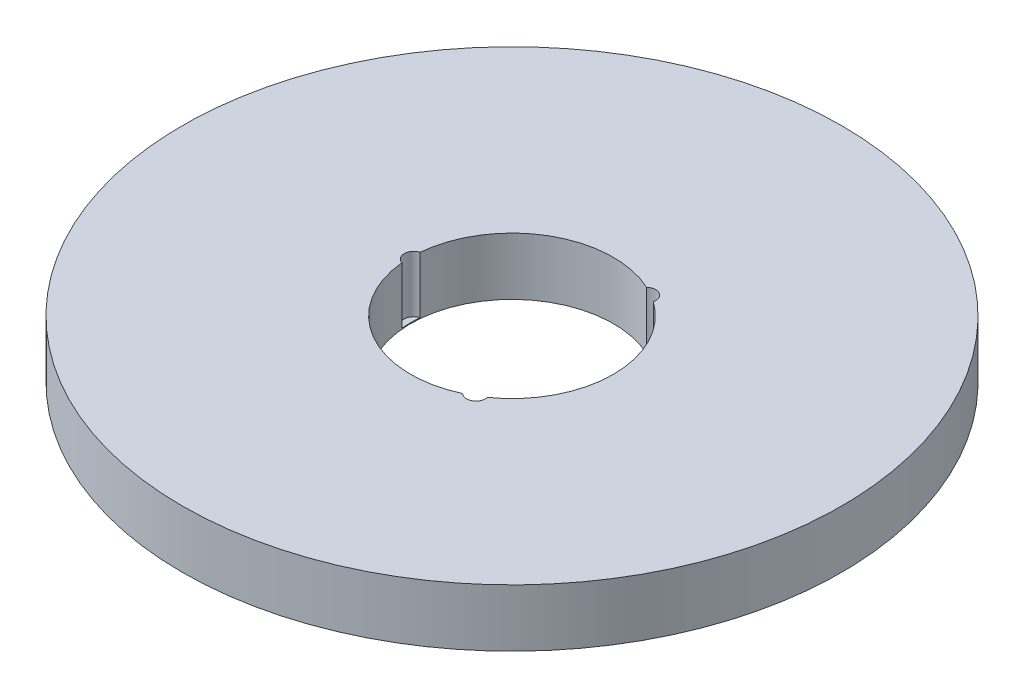
ISO-10303-21;
HEADER;
FILE_DESCRIPTION(('STEP AP214'),'2;1');
FILE_NAME('part.step','',(''),(''),'','','');
FILE_SCHEMA(('AUTOMOTIVE_DESIGN { 1 0 10303 214 1 1 1 1 }'));
ENDSEC;
DATA;
#1=APPLICATION_CONTEXT('core data for automotive mechanical design processes');
#2=APPLICATION_PROTOCOL_DEFINITION('international standard','automotive_design',2000,#1);
#3=PRODUCT_CONTEXT('',#1,'mechanical');
#4=PRODUCT('Part','Part','',(#3));
#5=PRODUCT_RELATED_PRODUCT_CATEGORY('part','',(#4));
#6=PRODUCT_DEFINITION_FORMATION('','',#4);
#7=PRODUCT_DEFINITION_CONTEXT('part definition',#1,'design');
#8=PRODUCT_DEFINITION('design','',#6,#7);
#9=PRODUCT_DEFINITION_SHAPE('','',#8);
#10=(LENGTH_UNIT() NAMED_UNIT(*) SI_UNIT(.MILLI.,.METRE.));
#11=(NAMED_UNIT(*) PLANE_ANGLE_UNIT() SI_UNIT($,.RADIAN.));
#12=(NAMED_UNIT(*) SI_UNIT($,.STERADIAN.) SOLID_ANGLE_UNIT());
#13=UNCERTAINTY_MEASURE_WITH_UNIT(LENGTH_MEASURE(1.E-05),#10,'distance_accuracy_value','');
#14=(GEOMETRIC_REPRESENTATION_CONTEXT(3) GLOBAL_UNCERTAINTY_ASSIGNED_CONTEXT((#13)) GLOBAL_UNIT_ASSIGNED_CONTEXT((#10,
#11,#12)) REPRESENTATION_CONTEXT('',''));
#15=CARTESIAN_POINT('',(0.,0.,0.));
#16=DIRECTION('',(0.,0.,1.));
#17=DIRECTION('',(1.,0.,0.));
#18=AXIS2_PLACEMENT_3D('',#15,#16,#17);
#19=CARTESIAN_POINT('',(0.,17.,0.));
#20=DIRECTION('',(0.,-1.,0.));
#21=DIRECTION('',(0.,0.,-1.));
#22=AXIS2_PLACEMENT_3D('',#19,#20,#21);
#23=CYLINDRICAL_SURFACE('',#22,97.5);
#24=CARTESIAN_POINT('',(0.,17.,0.));
#25=DIRECTION('',(0.,1.,0.));
#26=DIRECTION('',(0.,0.,1.));
#27=AXIS2_PLACEMENT_3D('',#24,#25,#26);
#28=CIRCLE('',#27,97.5);
#29=CARTESIAN_POINT('',(0.,17.,97.5));
#30=VERTEX_POINT('',#29);
#31=EDGE_CURVE('E130',#30,#30,#28,.T.);
#32=ORIENTED_EDGE('',*,*,#31,.F.);
#33=EDGE_LOOP('',(#32));
#34=FACE_BOUND('',#33,.T.);
#35=CARTESIAN_POINT('',(0.,0.,0.));
#36=DIRECTION('',(0.,1.,0.));
#37=DIRECTION('',(0.,0.,1.));
#38=AXIS2_PLACEMENT_3D('',#35,#36,#37);
#39=CIRCLE('',#38,97.5);
#40=CARTESIAN_POINT('',(0.,0.,97.5));
#41=VERTEX_POINT('',#40);
#42=EDGE_CURVE('E117',#41,#41,#39,.T.);
#43=ORIENTED_EDGE('',*,*,#42,.T.);
#44=EDGE_LOOP('',(#43));
#45=FACE_BOUND('',#44,.T.);
#46=ADVANCED_FACE('F39',(#34,#45),#23,.T.);
#47=CARTESIAN_POINT('',(0.,17.,0.));
#48=DIRECTION('',(0.,1.,0.));
#49=DIRECTION('',(0.,0.,1.));
#50=AXIS2_PLACEMENT_3D('',#47,#48,#49);
#51=PLANE('',#50);
#52=CARTESIAN_POINT('',(14.5297397758314,17.,25.1662475124942));
#53=DIRECTION('',(0.,1.,0.));
#54=DIRECTION('',(0.866025403784436,0.,-0.500000000000004));
#55=AXIS2_PLACEMENT_3D('',#52,#53,#54);
#56=CIRCLE('',#55,2.81733643312998);
#57=CARTESIAN_POINT('',(12.6048523469208,17.,27.2234769511965));
#58=VERTEX_POINT('',#57);
#59=CARTESIAN_POINT('',(17.2737964456161,17.,24.5278608189834));
#60=VERTEX_POINT('',#59);
#61=EDGE_CURVE('E148',#58,#60,#56,.T.);
#62=ORIENTED_EDGE('',*,*,#61,.F.);
#63=CARTESIAN_POINT('',(0.,17.,0.));
#64=DIRECTION('',(0.,1.,0.));
#65=DIRECTION('',(0.,0.,1.));
#66=AXIS2_PLACEMENT_3D('',#63,#64,#65);
#67=CIRCLE('',#66,30.);
#68=CARTESIAN_POINT('',(-29.8786487925367,17.,2.69561613221309));
#69=VERTEX_POINT('',#68);
#70=EDGE_CURVE('E113',#69,#58,#67,.T.);
#71=ORIENTED_EDGE('',*,*,#70,.F.);
#72=CARTESIAN_POINT('',(-29.0594795516626,17.,0.));
#73=DIRECTION('',(0.,1.,0.));
#74=DIRECTION('',(0.,0.,1.));
#75=AXIS2_PLACEMENT_3D('',#72,#73,#74);
#76=CIRCLE('',#75,2.81733643312998);
#77=CARTESIAN_POINT('',(-29.8786487925367,17.,-2.69561613221309));
#78=VERTEX_POINT('',#77);
#79=EDGE_CURVE('E125',#78,#69,#76,.T.);
#80=ORIENTED_EDGE('',*,*,#79,.F.);
#81=CARTESIAN_POINT('',(12.6048523469204,17.,-27.2234769511967));
#82=VERTEX_POINT('',#81);
#83=EDGE_CURVE('E107',#82,#78,#67,.T.);
#84=ORIENTED_EDGE('',*,*,#83,.F.);
#85=CARTESIAN_POINT('',(14.5297397758311,17.,-25.1662475124944));
#86=DIRECTION('',(0.,1.,0.));
#87=DIRECTION('',(-0.866025403784443,0.,-0.499999999999992));
#88=AXIS2_PLACEMENT_3D('',#85,#86,#87);
#89=CIRCLE('',#88,2.81733643312998);
#90=CARTESIAN_POINT('',(17.2737964456158,17.,-24.5278608189836));
#91=VERTEX_POINT('',#90);
#92=EDGE_CURVE('E95',#91,#82,#89,.T.);
#93=ORIENTED_EDGE('',*,*,#92,.F.);
#94=EDGE_CURVE('E106',#60,#91,#67,.T.);
#95=ORIENTED_EDGE('',*,*,#94,.F.);
#96=EDGE_LOOP('',(#62,#71,#80,#84,#93,#95));
#97=FACE_BOUND('',#96,.T.);
#98=ORIENTED_EDGE('',*,*,#31,.T.);
#99=EDGE_LOOP('',(#98));
#100=FACE_BOUND('',#99,.T.);
#101=ADVANCED_FACE('F102',(#97,#100),#51,.T.);
#102=CARTESIAN_POINT('',(0.,0.,0.));
#103=DIRECTION('',(0.,1.,0.));
#104=DIRECTION('',(0.,0.,1.));
#105=AXIS2_PLACEMENT_3D('',#102,#103,#104);
#106=PLANE('',#105);
#107=CARTESIAN_POINT('',(0.,0.,0.));
#108=DIRECTION('',(0.,1.,0.));
#109=DIRECTION('',(0.,0.,1.));
#110=AXIS2_PLACEMENT_3D('',#107,#108,#109);
#111=CIRCLE('',#110,30.);
#112=CARTESIAN_POINT('',(0.,0.,30.));
#113=VERTEX_POINT('',#112);
#114=EDGE_CURVE('E118',#113,#113,#111,.T.);
#115=ORIENTED_EDGE('',*,*,#114,.T.);
#116=EDGE_LOOP('',(#115));
#117=FACE_BOUND('',#116,.T.);
#118=ORIENTED_EDGE('',*,*,#42,.F.);
#119=EDGE_LOOP('',(#118));
#120=FACE_BOUND('',#119,.T.);
#121=ADVANCED_FACE('F161',(#117,#120),#106,.F.);
#122=CARTESIAN_POINT('',(0.,17.,0.));
#123=DIRECTION('',(0.,-1.,0.));
#124=DIRECTION('',(0.,0.,-1.));
#125=AXIS2_PLACEMENT_3D('',#122,#123,#124);
#126=CYLINDRICAL_SURFACE('',#125,30.);
#127=DIRECTION('',(0.,1.,0.));
#128=VECTOR('',#127,1.);
#129=CARTESIAN_POINT('',(12.6048523469208,8.62470974675994,27.2234769511965));
#130=LINE('',#129,#128);
#131=CARTESIAN_POINT('',(12.6048523469208,0.249419493519875,27.2234769511965));
#132=VERTEX_POINT('',#131);
#133=EDGE_CURVE('E11',#132,#58,#130,.T.);
#134=ORIENTED_EDGE('',*,*,#133,.F.);
#135=CARTESIAN_POINT('',(0.,0.249419493519875,0.));
#136=DIRECTION('',(0.,1.,0.));
#137=DIRECTION('',(0.,0.,1.));
#138=AXIS2_PLACEMENT_3D('',#135,#136,#137);
#139=CIRCLE('',#138,30.);
#140=CARTESIAN_POINT('',(17.2737964456161,0.249419493519875,24.5278608189834));
#141=VERTEX_POINT('',#140);
#142=EDGE_CURVE('E100',#132,#141,#139,.T.);
#143=ORIENTED_EDGE('',*,*,#142,.T.);
#144=DIRECTION('',(0.,1.,0.));
#145=VECTOR('',#144,1.);
#146=CARTESIAN_POINT('',(17.2737964456161,8.62470974675994,24.5278608189834));
#147=LINE('',#146,#145);
#148=EDGE_CURVE('E46',#60,#141,#147,.F.);
#149=ORIENTED_EDGE('',*,*,#148,.F.);
#150=ORIENTED_EDGE('',*,*,#94,.T.);
#151=DIRECTION('',(0.,1.,0.));
#152=VECTOR('',#151,1.);
#153=CARTESIAN_POINT('',(17.2737964456158,8.62470974675994,-24.5278608189836));
#154=LINE('',#153,#152);
#155=CARTESIAN_POINT('',(17.2737964456158,0.249419493519875,-24.5278608189836));
#156=VERTEX_POINT('',#155);
#157=EDGE_CURVE('E90',#156,#91,#154,.T.);
#158=ORIENTED_EDGE('',*,*,#157,.F.);
#159=CARTESIAN_POINT('',(0.,0.249419493519875,0.));
#160=DIRECTION('',(0.,1.,0.));
#161=DIRECTION('',(0.,0.,1.));
#162=AXIS2_PLACEMENT_3D('',#159,#160,#161);
#163=CIRCLE('',#162,30.);
#164=CARTESIAN_POINT('',(12.6048523469204,0.249419493519875,-27.2234769511967));
#165=VERTEX_POINT('',#164);
#166=EDGE_CURVE('E143',#156,#165,#163,.T.);
#167=ORIENTED_EDGE('',*,*,#166,.T.);
#168=DIRECTION('',(0.,1.,0.));
#169=VECTOR('',#168,1.);
#170=CARTESIAN_POINT('',(12.6048523469204,8.62470974675994,-27.2234769511967));
#171=LINE('',#170,#169);
#172=EDGE_CURVE('E98',#82,#165,#171,.F.);
#173=ORIENTED_EDGE('',*,*,#172,.F.);
#174=ORIENTED_EDGE('',*,*,#83,.T.);
#175=DIRECTION('',(0.,1.,0.));
#176=VECTOR('',#175,1.);
#177=CARTESIAN_POINT('',(-29.8786487925367,8.62470974675994,-2.69561613221309));
#178=LINE('',#177,#176);
#179=CARTESIAN_POINT('',(-29.8786487925367,0.249419493519875,-2.69561613221309));
#180=VERTEX_POINT('',#179);
#181=EDGE_CURVE('E137',#180,#78,#178,.T.);
#182=ORIENTED_EDGE('',*,*,#181,.F.);
#183=CARTESIAN_POINT('',(0.,0.249419493519875,0.));
#184=DIRECTION('',(0.,1.,0.));
#185=DIRECTION('',(0.,0.,1.));
#186=AXIS2_PLACEMENT_3D('',#183,#184,#185);
#187=CIRCLE('',#186,30.);
#188=CARTESIAN_POINT('',(-29.8786487925367,0.249419493519875,2.69561613221309));
#189=VERTEX_POINT('',#188);
#190=EDGE_CURVE('E128',#180,#189,#187,.T.);
#191=ORIENTED_EDGE('',*,*,#190,.T.);
#192=DIRECTION('',(0.,1.,0.));
#193=VECTOR('',#192,1.);
#194=CARTESIAN_POINT('',(-29.8786487925367,8.62470974675994,2.69561613221309));
#195=LINE('',#194,#193);
#196=EDGE_CURVE('E134',#69,#189,#195,.F.);
#197=ORIENTED_EDGE('',*,*,#196,.F.);
#198=ORIENTED_EDGE('',*,*,#70,.T.);
#199=EDGE_LOOP('',(#134,#143,#149,#150,#158,#167,#173,#174,#182,#191,#197,#198));
#200=FACE_BOUND('',#199,.T.);
#201=ORIENTED_EDGE('',*,*,#114,.F.);
#202=EDGE_LOOP('',(#201));
#203=FACE_BOUND('',#202,.T.);
#204=ADVANCED_FACE('F115',(#200,#203),#126,.F.);
#205=CARTESIAN_POINT('',(-29.0594795516626,0.249419493519875,0.));
#206=DIRECTION('',(0.,1.,0.));
#207=DIRECTION('',(0.,0.,1.));
#208=AXIS2_PLACEMENT_3D('',#205,#206,#207);
#209=CYLINDRICAL_SURFACE('',#208,2.81733643312998);
#210=ORIENTED_EDGE('',*,*,#181,.T.);
#211=ORIENTED_EDGE('',*,*,#79,.T.);
#212=ORIENTED_EDGE('',*,*,#196,.T.);
#213=CARTESIAN_POINT('',(-29.0594795516626,0.249419493519875,0.));
#214=DIRECTION('',(0.,1.,0.));
#215=DIRECTION('',(0.,0.,1.));
#216=AXIS2_PLACEMENT_3D('',#213,#214,#215);
#217=CIRCLE('',#216,2.81733643312998);
#218=EDGE_CURVE('E127',#180,#189,#217,.T.);
#219=ORIENTED_EDGE('',*,*,#218,.F.);
#220=EDGE_LOOP('',(#210,#211,#212,#219));
#221=FACE_BOUND('',#220,.T.);
#222=ADVANCED_FACE('F175',(#221),#209,.F.);
#223=CARTESIAN_POINT('',(-29.0594795516626,0.249419493519875,0.));
#224=DIRECTION('',(0.,1.,0.));
#225=DIRECTION('',(0.,0.,1.));
#226=AXIS2_PLACEMENT_3D('',#223,#224,#225);
#227=PLANE('',#226);
#228=ORIENTED_EDGE('',*,*,#218,.T.);
#229=ORIENTED_EDGE('',*,*,#190,.F.);
#230=EDGE_LOOP('',(#228,#229));
#231=FACE_BOUND('',#230,.T.);
#232=ADVANCED_FACE('F176',(#231),#227,.T.);
#233=CARTESIAN_POINT('',(14.5297397758311,0.249419493519875,-25.1662475124944));
#234=DIRECTION('',(0.,1.,0.));
#235=DIRECTION('',(0.,0.,1.));
#236=AXIS2_PLACEMENT_3D('',#233,#234,#235);
#237=CYLINDRICAL_SURFACE('',#236,2.81733643312998);
#238=ORIENTED_EDGE('',*,*,#157,.T.);
#239=ORIENTED_EDGE('',*,*,#92,.T.);
#240=ORIENTED_EDGE('',*,*,#172,.T.);
#241=CARTESIAN_POINT('',(14.5297397758311,0.249419493519875,-25.1662475124944));
#242=DIRECTION('',(0.,1.,0.));
#243=DIRECTION('',(-0.866025403784443,0.,-0.499999999999992));
#244=AXIS2_PLACEMENT_3D('',#241,#242,#243);
#245=CIRCLE('',#244,2.81733643312998);
#246=EDGE_CURVE('E56',#156,#165,#245,.T.);
#247=ORIENTED_EDGE('',*,*,#246,.F.);
#248=EDGE_LOOP('',(#238,#239,#240,#247));
#249=FACE_BOUND('',#248,.T.);
#250=ADVANCED_FACE('F93',(#249),#237,.F.);
#251=CARTESIAN_POINT('',(14.5297397758311,0.249419493519875,-25.1662475124944));
#252=DIRECTION('',(0.,1.,0.));
#253=DIRECTION('',(-0.866025403784443,0.,-0.499999999999992));
#254=AXIS2_PLACEMENT_3D('',#251,#252,#253);
#255=PLANE('',#254);
#256=ORIENTED_EDGE('',*,*,#246,.T.);
#257=ORIENTED_EDGE('',*,*,#166,.F.);
#258=EDGE_LOOP('',(#256,#257));
#259=FACE_BOUND('',#258,.T.);
#260=ADVANCED_FACE('F153',(#259),#255,.T.);
#261=CARTESIAN_POINT('',(14.5297397758314,0.249419493519875,25.1662475124942));
#262=DIRECTION('',(0.,1.,0.));
#263=DIRECTION('',(0.,0.,1.));
#264=AXIS2_PLACEMENT_3D('',#261,#262,#263);
#265=CYLINDRICAL_SURFACE('',#264,2.81733643312998);
#266=ORIENTED_EDGE('',*,*,#133,.T.);
#267=ORIENTED_EDGE('',*,*,#61,.T.);
#268=ORIENTED_EDGE('',*,*,#148,.T.);
#269=CARTESIAN_POINT('',(14.5297397758314,0.249419493519875,25.1662475124942));
#270=DIRECTION('',(0.,1.,0.));
#271=DIRECTION('',(0.866025403784436,0.,-0.500000000000004));
#272=AXIS2_PLACEMENT_3D('',#269,#270,#271);
#273=CIRCLE('',#272,2.81733643312998);
#274=EDGE_CURVE('E55',#132,#141,#273,.T.);
#275=ORIENTED_EDGE('',*,*,#274,.F.);
#276=EDGE_LOOP('',(#266,#267,#268,#275));
#277=FACE_BOUND('',#276,.T.);
#278=ADVANCED_FACE('F144',(#277),#265,.F.);
#279=CARTESIAN_POINT('',(14.5297397758314,0.249419493519875,25.1662475124942));
#280=DIRECTION('',(0.,1.,0.));
#281=DIRECTION('',(0.866025403784436,0.,-0.500000000000004));
#282=AXIS2_PLACEMENT_3D('',#279,#280,#281);
#283=PLANE('',#282);
#284=ORIENTED_EDGE('',*,*,#274,.T.);
#285=ORIENTED_EDGE('',*,*,#142,.F.);
#286=EDGE_LOOP('',(#284,#285));
#287=FACE_BOUND('',#286,.T.);
#288=ADVANCED_FACE('F150',(#287),#283,.T.);
#289=CLOSED_SHELL('',(#46,#101,#121,#204,#222,#232,#250,#260,#278,#288));
#290=MANIFOLD_SOLID_BREP('B2',#289);
#291=ADVANCED_BREP_SHAPE_REPRESENTATION('',(#18,#290),#14);
#292=SHAPE_DEFINITION_REPRESENTATION(#9,#291);
ENDSEC;
END-ISO-10303-21;
